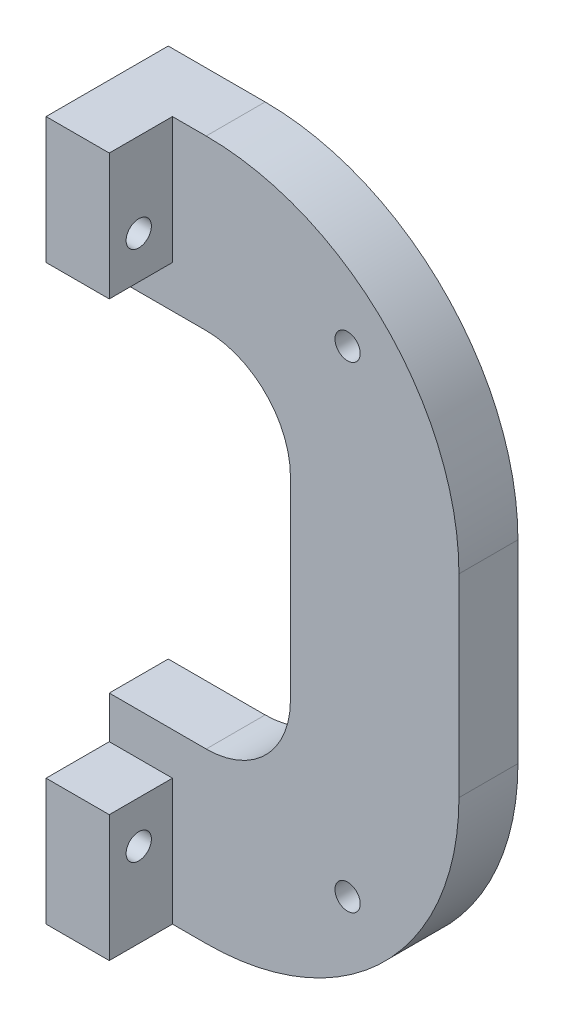
ISO-10303-21;
HEADER;
FILE_DESCRIPTION(('STEP AP214'),'2;1');
FILE_NAME('part.step','',(''),(''),'','','');
FILE_SCHEMA(('AUTOMOTIVE_DESIGN { 1 0 10303 214 1 1 1 1 }'));
ENDSEC;
DATA;
#1=APPLICATION_CONTEXT('core data for automotive mechanical design processes');
#2=APPLICATION_PROTOCOL_DEFINITION('international standard','automotive_design',2000,#1);
#3=PRODUCT_CONTEXT('',#1,'mechanical');
#4=PRODUCT('Part','Part','',(#3));
#5=PRODUCT_RELATED_PRODUCT_CATEGORY('part','',(#4));
#6=PRODUCT_DEFINITION_FORMATION('','',#4);
#7=PRODUCT_DEFINITION_CONTEXT('part definition',#1,'design');
#8=PRODUCT_DEFINITION('design','',#6,#7);
#9=PRODUCT_DEFINITION_SHAPE('','',#8);
#10=(LENGTH_UNIT() NAMED_UNIT(*) SI_UNIT(.MILLI.,.METRE.));
#11=(NAMED_UNIT(*) PLANE_ANGLE_UNIT() SI_UNIT($,.RADIAN.));
#12=(NAMED_UNIT(*) SI_UNIT($,.STERADIAN.) SOLID_ANGLE_UNIT());
#13=UNCERTAINTY_MEASURE_WITH_UNIT(LENGTH_MEASURE(1.E-05),#10,'distance_accuracy_value','');
#14=(GEOMETRIC_REPRESENTATION_CONTEXT(3) GLOBAL_UNCERTAINTY_ASSIGNED_CONTEXT((#13)) GLOBAL_UNIT_ASSIGNED_CONTEXT((#10,
#11,#12)) REPRESENTATION_CONTEXT('',''));
#15=CARTESIAN_POINT('',(0.,0.,0.));
#16=DIRECTION('',(0.,0.,1.));
#17=DIRECTION('',(1.,0.,0.));
#18=AXIS2_PLACEMENT_3D('',#15,#16,#17);
#19=CARTESIAN_POINT('',(0.,0.,7.));
#20=DIRECTION('',(0.,0.,1.));
#21=DIRECTION('',(1.,0.,0.));
#22=AXIS2_PLACEMENT_3D('',#19,#20,#21);
#23=PLANE('',#22);
#24=CARTESIAN_POINT('',(28.2842712474618,28.284271247462,7.));
#25=DIRECTION('',(0.,0.,1.));
#26=DIRECTION('',(1.,0.,0.));
#27=AXIS2_PLACEMENT_3D('',#24,#25,#26);
#28=CIRCLE('',#27,1.5);
#29=CARTESIAN_POINT('',(29.7842712474618,28.284271247462,7.));
#30=VERTEX_POINT('',#29);
#31=EDGE_CURVE('E199',#30,#30,#28,.T.);
#32=ORIENTED_EDGE('',*,*,#31,.F.);
#33=EDGE_LOOP('',(#32));
#34=FACE_BOUND('',#33,.T.);
#35=CARTESIAN_POINT('',(28.2842712474618,-28.284271247462,7.));
#36=DIRECTION('',(0.,0.,1.));
#37=DIRECTION('',(1.,0.,0.));
#38=AXIS2_PLACEMENT_3D('',#35,#36,#37);
#39=CIRCLE('',#38,1.5);
#40=CARTESIAN_POINT('',(29.7842712474618,-28.284271247462,7.));
#41=VERTEX_POINT('',#40);
#42=EDGE_CURVE('E187',#41,#41,#39,.T.);
#43=ORIENTED_EDGE('',*,*,#42,.F.);
#44=EDGE_LOOP('',(#43));
#45=FACE_BOUND('',#44,.T.);
#46=DIRECTION('',(1.,0.,0.));
#47=VECTOR('',#46,1.);
#48=CARTESIAN_POINT('',(0.,-21.5,7.));
#49=LINE('',#48,#47);
#50=CARTESIAN_POINT('',(0.,-21.5,7.));
#51=VERTEX_POINT('',#50);
#52=CARTESIAN_POINT('',(11.4999999999999,-21.5,7.));
#53=VERTEX_POINT('',#52);
#54=EDGE_CURVE('E262',#51,#53,#49,.T.);
#55=ORIENTED_EDGE('',*,*,#54,.F.);
#56=DIRECTION('',(0.,1.,0.));
#57=VECTOR('',#56,1.);
#58=CARTESIAN_POINT('',(0.,-26.5,7.));
#59=LINE('',#58,#57);
#60=CARTESIAN_POINT('',(0.,-26.5,7.));
#61=VERTEX_POINT('',#60);
#62=EDGE_CURVE('E190',#61,#51,#59,.T.);
#63=ORIENTED_EDGE('',*,*,#62,.F.);
#64=DIRECTION('',(1.,0.,0.));
#65=VECTOR('',#64,1.);
#66=CARTESIAN_POINT('',(0.,-26.5,7.));
#67=LINE('',#66,#65);
#68=CARTESIAN_POINT('',(7.50000000000001,-26.5,7.));
#69=VERTEX_POINT('',#68);
#70=EDGE_CURVE('E184',#61,#69,#67,.T.);
#71=ORIENTED_EDGE('',*,*,#70,.T.);
#72=DIRECTION('',(0.,1.,0.));
#73=VECTOR('',#72,1.);
#74=CARTESIAN_POINT('',(7.5,-41.5,7.));
#75=LINE('',#74,#73);
#76=CARTESIAN_POINT('',(7.5,-41.5,7.));
#77=VERTEX_POINT('',#76);
#78=EDGE_CURVE('E208',#77,#69,#75,.T.);
#79=ORIENTED_EDGE('',*,*,#78,.F.);
#80=DIRECTION('',(1.,0.,0.));
#81=VECTOR('',#80,1.);
#82=CARTESIAN_POINT('',(0.,-41.5,7.));
#83=LINE('',#82,#81);
#84=CARTESIAN_POINT('',(11.4999999999999,-41.5,7.));
#85=VERTEX_POINT('',#84);
#86=EDGE_CURVE('E264',#77,#85,#83,.T.);
#87=ORIENTED_EDGE('',*,*,#86,.T.);
#88=CARTESIAN_POINT('',(11.5,-11.5,7.));
#89=DIRECTION('',(0.,0.,1.));
#90=DIRECTION('',(1.,0.,0.));
#91=AXIS2_PLACEMENT_3D('',#88,#89,#90);
#92=CIRCLE('',#91,30.);
#93=CARTESIAN_POINT('',(41.5,-11.4999999999998,7.));
#94=VERTEX_POINT('',#93);
#95=EDGE_CURVE('E266',#85,#94,#92,.T.);
#96=ORIENTED_EDGE('',*,*,#95,.T.);
#97=DIRECTION('',(0.,1.,0.));
#98=VECTOR('',#97,1.);
#99=CARTESIAN_POINT('',(41.5,0.,7.));
#100=LINE('',#99,#98);
#101=CARTESIAN_POINT('',(41.5,11.4999999999999,7.));
#102=VERTEX_POINT('',#101);
#103=EDGE_CURVE('E243',#94,#102,#100,.T.);
#104=ORIENTED_EDGE('',*,*,#103,.T.);
#105=CARTESIAN_POINT('',(11.5,11.5,7.));
#106=DIRECTION('',(0.,0.,1.));
#107=DIRECTION('',(1.,0.,0.));
#108=AXIS2_PLACEMENT_3D('',#105,#106,#107);
#109=CIRCLE('',#108,30.);
#110=CARTESIAN_POINT('',(11.5,41.5,7.));
#111=VERTEX_POINT('',#110);
#112=EDGE_CURVE('E246',#102,#111,#109,.T.);
#113=ORIENTED_EDGE('',*,*,#112,.T.);
#114=DIRECTION('',(-1.,0.,0.));
#115=VECTOR('',#114,1.);
#116=CARTESIAN_POINT('',(0.,41.5,7.));
#117=LINE('',#116,#115);
#118=CARTESIAN_POINT('',(7.5,41.5,7.));
#119=VERTEX_POINT('',#118);
#120=EDGE_CURVE('E249',#111,#119,#117,.T.);
#121=ORIENTED_EDGE('',*,*,#120,.T.);
#122=DIRECTION('',(0.,1.,0.));
#123=VECTOR('',#122,1.);
#124=CARTESIAN_POINT('',(7.5,41.5,7.));
#125=LINE('',#124,#123);
#126=CARTESIAN_POINT('',(7.5,26.5,7.));
#127=VERTEX_POINT('',#126);
#128=EDGE_CURVE('E169',#127,#119,#125,.T.);
#129=ORIENTED_EDGE('',*,*,#128,.F.);
#130=DIRECTION('',(1.,0.,0.));
#131=VECTOR('',#130,1.);
#132=CARTESIAN_POINT('',(0.,26.5,7.));
#133=LINE('',#132,#131);
#134=CARTESIAN_POINT('',(0.,26.5,7.));
#135=VERTEX_POINT('',#134);
#136=EDGE_CURVE('E162',#135,#127,#133,.T.);
#137=ORIENTED_EDGE('',*,*,#136,.F.);
#138=DIRECTION('',(0.,1.,0.));
#139=VECTOR('',#138,1.);
#140=CARTESIAN_POINT('',(0.,26.5,7.));
#141=LINE('',#140,#139);
#142=CARTESIAN_POINT('',(0.,21.5,7.));
#143=VERTEX_POINT('',#142);
#144=EDGE_CURVE('E166',#143,#135,#141,.T.);
#145=ORIENTED_EDGE('',*,*,#144,.F.);
#146=DIRECTION('',(-1.,0.,0.));
#147=VECTOR('',#146,1.);
#148=CARTESIAN_POINT('',(0.,21.5,7.));
#149=LINE('',#148,#147);
#150=CARTESIAN_POINT('',(11.4999999999999,21.5,7.));
#151=VERTEX_POINT('',#150);
#152=EDGE_CURVE('E251',#151,#143,#149,.T.);
#153=ORIENTED_EDGE('',*,*,#152,.F.);
#154=CARTESIAN_POINT('',(11.5,11.5,7.));
#155=DIRECTION('',(0.,0.,1.));
#156=DIRECTION('',(1.,0.,0.));
#157=AXIS2_PLACEMENT_3D('',#154,#155,#156);
#158=CIRCLE('',#157,10.);
#159=CARTESIAN_POINT('',(21.5,11.4999999999999,7.));
#160=VERTEX_POINT('',#159);
#161=EDGE_CURVE('E253',#160,#151,#158,.T.);
#162=ORIENTED_EDGE('',*,*,#161,.F.);
#163=DIRECTION('',(0.,1.,0.));
#164=VECTOR('',#163,1.);
#165=CARTESIAN_POINT('',(21.5,0.,7.));
#166=LINE('',#165,#164);
#167=CARTESIAN_POINT('',(21.5,-11.4999999999999,7.));
#168=VERTEX_POINT('',#167);
#169=EDGE_CURVE('E256',#168,#160,#166,.T.);
#170=ORIENTED_EDGE('',*,*,#169,.F.);
#171=CARTESIAN_POINT('',(11.5,-11.5,7.));
#172=DIRECTION('',(0.,0.,1.));
#173=DIRECTION('',(1.,0.,0.));
#174=AXIS2_PLACEMENT_3D('',#171,#172,#173);
#175=CIRCLE('',#174,10.);
#176=EDGE_CURVE('E259',#53,#168,#175,.T.);
#177=ORIENTED_EDGE('',*,*,#176,.F.);
#178=EDGE_LOOP('',(#55,#63,#71,#79,#87,#96,#104,#113,#121,#129,#137,#145,#153,#162,#170,#177));
#179=FACE_BOUND('',#178,.T.);
#180=ADVANCED_FACE('F35',(#34,#45,#179),#23,.T.);
#181=CARTESIAN_POINT('',(41.5,0.,7.));
#182=DIRECTION('',(-1.,0.,0.));
#183=DIRECTION('',(0.,-1.,0.));
#184=AXIS2_PLACEMENT_3D('',#181,#182,#183);
#185=PLANE('',#184);
#186=DIRECTION('',(0.,1.,0.));
#187=VECTOR('',#186,1.);
#188=CARTESIAN_POINT('',(41.5,0.,0.));
#189=LINE('',#188,#187);
#190=CARTESIAN_POINT('',(41.5,-11.4999999999998,0.));
#191=VERTEX_POINT('',#190);
#192=CARTESIAN_POINT('',(41.5,11.4999999999999,0.));
#193=VERTEX_POINT('',#192);
#194=EDGE_CURVE('E242',#191,#193,#189,.T.);
#195=ORIENTED_EDGE('',*,*,#194,.T.);
#196=DIRECTION('',(0.,0.,-1.));
#197=VECTOR('',#196,1.);
#198=CARTESIAN_POINT('',(41.5,11.4999999999999,7.));
#199=LINE('',#198,#197);
#200=EDGE_CURVE('E11',#102,#193,#199,.T.);
#201=ORIENTED_EDGE('',*,*,#200,.F.);
#202=ORIENTED_EDGE('',*,*,#103,.F.);
#203=DIRECTION('',(0.,0.,-1.));
#204=VECTOR('',#203,1.);
#205=CARTESIAN_POINT('',(41.5,-11.4999999999998,7.));
#206=LINE('',#205,#204);
#207=EDGE_CURVE('E268',#94,#191,#206,.T.);
#208=ORIENTED_EDGE('',*,*,#207,.T.);
#209=EDGE_LOOP('',(#195,#201,#202,#208));
#210=FACE_BOUND('',#209,.T.);
#211=ADVANCED_FACE('F37',(#210),#185,.F.);
#212=CARTESIAN_POINT('',(11.5,11.5,7.));
#213=DIRECTION('',(0.,0.,-1.));
#214=DIRECTION('',(-1.,0.,0.));
#215=AXIS2_PLACEMENT_3D('',#212,#213,#214);
#216=CYLINDRICAL_SURFACE('',#215,30.);
#217=CARTESIAN_POINT('',(11.5,11.5,0.));
#218=DIRECTION('',(0.,0.,1.));
#219=DIRECTION('',(1.,0.,0.));
#220=AXIS2_PLACEMENT_3D('',#217,#218,#219);
#221=CIRCLE('',#220,30.);
#222=CARTESIAN_POINT('',(11.5,41.5,0.));
#223=VERTEX_POINT('',#222);
#224=EDGE_CURVE('E271',#193,#223,#221,.T.);
#225=ORIENTED_EDGE('',*,*,#224,.T.);
#226=DIRECTION('',(0.,0.,-1.));
#227=VECTOR('',#226,1.);
#228=CARTESIAN_POINT('',(11.5,41.5,7.));
#229=LINE('',#228,#227);
#230=EDGE_CURVE('E44',#111,#223,#229,.T.);
#231=ORIENTED_EDGE('',*,*,#230,.F.);
#232=ORIENTED_EDGE('',*,*,#112,.F.);
#233=ORIENTED_EDGE('',*,*,#200,.T.);
#234=EDGE_LOOP('',(#225,#231,#232,#233));
#235=FACE_BOUND('',#234,.T.);
#236=ADVANCED_FACE('F349',(#235),#216,.T.);
#237=CARTESIAN_POINT('',(0.,41.5,7.));
#238=DIRECTION('',(0.,-1.,0.));
#239=DIRECTION('',(0.,0.,-1.));
#240=AXIS2_PLACEMENT_3D('',#237,#238,#239);
#241=PLANE('',#240);
#242=DIRECTION('',(-1.,0.,0.));
#243=VECTOR('',#242,1.);
#244=CARTESIAN_POINT('',(0.,41.5,0.));
#245=LINE('',#244,#243);
#246=CARTESIAN_POINT('',(0.,41.5,0.));
#247=VERTEX_POINT('',#246);
#248=EDGE_CURVE('E273',#223,#247,#245,.T.);
#249=ORIENTED_EDGE('',*,*,#248,.T.);
#250=DIRECTION('',(0.,0.,-1.));
#251=VECTOR('',#250,1.);
#252=CARTESIAN_POINT('',(0.,41.5,7.));
#253=LINE('',#252,#251);
#254=CARTESIAN_POINT('',(0.,41.5,14.5));
#255=VERTEX_POINT('',#254);
#256=EDGE_CURVE('E318',#255,#247,#253,.T.);
#257=ORIENTED_EDGE('',*,*,#256,.F.);
#258=DIRECTION('',(-1.,0.,0.));
#259=VECTOR('',#258,1.);
#260=CARTESIAN_POINT('',(0.,41.5,14.5));
#261=LINE('',#260,#259);
#262=CARTESIAN_POINT('',(7.5,41.5,14.5));
#263=VERTEX_POINT('',#262);
#264=EDGE_CURVE('E233',#263,#255,#261,.T.);
#265=ORIENTED_EDGE('',*,*,#264,.F.);
#266=DIRECTION('',(0.,0.,-1.));
#267=VECTOR('',#266,1.);
#268=CARTESIAN_POINT('',(7.5,41.5,14.5));
#269=LINE('',#268,#267);
#270=EDGE_CURVE('E238',#263,#119,#269,.T.);
#271=ORIENTED_EDGE('',*,*,#270,.T.);
#272=ORIENTED_EDGE('',*,*,#120,.F.);
#273=ORIENTED_EDGE('',*,*,#230,.T.);
#274=EDGE_LOOP('',(#249,#257,#265,#271,#272,#273));
#275=FACE_BOUND('',#274,.T.);
#276=ADVANCED_FACE('F393',(#275),#241,.F.);
#277=CARTESIAN_POINT('',(0.,0.,7.));
#278=DIRECTION('',(-1.,0.,0.));
#279=DIRECTION('',(0.,0.,1.));
#280=AXIS2_PLACEMENT_3D('',#277,#278,#279);
#281=PLANE('',#280);
#282=ORIENTED_EDGE('',*,*,#144,.T.);
#283=DIRECTION('',(0.,0.,1.));
#284=VECTOR('',#283,1.);
#285=CARTESIAN_POINT('',(0.,26.5,14.5));
#286=LINE('',#285,#284);
#287=CARTESIAN_POINT('',(0.,26.5,14.5));
#288=VERTEX_POINT('',#287);
#289=EDGE_CURVE('E171',#135,#288,#286,.T.);
#290=ORIENTED_EDGE('',*,*,#289,.T.);
#291=DIRECTION('',(0.,-1.,0.));
#292=VECTOR('',#291,1.);
#293=CARTESIAN_POINT('',(0.,21.5,14.5));
#294=LINE('',#293,#292);
#295=EDGE_CURVE('E236',#255,#288,#294,.T.);
#296=ORIENTED_EDGE('',*,*,#295,.F.);
#297=ORIENTED_EDGE('',*,*,#256,.T.);
#298=DIRECTION('',(0.,1.,0.));
#299=VECTOR('',#298,1.);
#300=CARTESIAN_POINT('',(0.,0.,0.));
#301=LINE('',#300,#299);
#302=CARTESIAN_POINT('',(0.,21.5,0.));
#303=VERTEX_POINT('',#302);
#304=EDGE_CURVE('E276',#303,#247,#301,.T.);
#305=ORIENTED_EDGE('',*,*,#304,.F.);
#306=DIRECTION('',(0.,0.,-1.));
#307=VECTOR('',#306,1.);
#308=CARTESIAN_POINT('',(0.,21.5,7.));
#309=LINE('',#308,#307);
#310=EDGE_CURVE('E182',#143,#303,#309,.T.);
#311=ORIENTED_EDGE('',*,*,#310,.F.);
#312=EDGE_LOOP('',(#282,#290,#296,#297,#305,#311));
#313=FACE_BOUND('',#312,.T.);
#314=CARTESIAN_POINT('',(0.,31.5,11.));
#315=DIRECTION('',(1.,0.,0.));
#316=DIRECTION('',(0.,1.,0.));
#317=AXIS2_PLACEMENT_3D('',#314,#315,#316);
#318=CIRCLE('',#317,1.5);
#319=CARTESIAN_POINT('',(0.,33.,11.));
#320=VERTEX_POINT('',#319);
#321=EDGE_CURVE('E205',#320,#320,#318,.T.);
#322=ORIENTED_EDGE('',*,*,#321,.T.);
#323=EDGE_LOOP('',(#322));
#324=FACE_BOUND('',#323,.T.);
#325=ADVANCED_FACE('F179',(#313,#324),#281,.T.);
#326=CARTESIAN_POINT('',(0.,21.5,7.));
#327=DIRECTION('',(0.,-1.,0.));
#328=DIRECTION('',(0.,0.,-1.));
#329=AXIS2_PLACEMENT_3D('',#326,#327,#328);
#330=PLANE('',#329);
#331=ORIENTED_EDGE('',*,*,#152,.T.);
#332=ORIENTED_EDGE('',*,*,#310,.T.);
#333=DIRECTION('',(-1.,0.,0.));
#334=VECTOR('',#333,1.);
#335=CARTESIAN_POINT('',(0.,21.5,0.));
#336=LINE('',#335,#334);
#337=CARTESIAN_POINT('',(11.4999999999999,21.5,0.));
#338=VERTEX_POINT('',#337);
#339=EDGE_CURVE('E279',#338,#303,#336,.T.);
#340=ORIENTED_EDGE('',*,*,#339,.F.);
#341=DIRECTION('',(0.,0.,-1.));
#342=VECTOR('',#341,1.);
#343=CARTESIAN_POINT('',(11.4999999999999,21.5,7.));
#344=LINE('',#343,#342);
#345=EDGE_CURVE('E315',#151,#338,#344,.T.);
#346=ORIENTED_EDGE('',*,*,#345,.F.);
#347=EDGE_LOOP('',(#331,#332,#340,#346));
#348=FACE_BOUND('',#347,.T.);
#349=ADVANCED_FACE('F386',(#348),#330,.T.);
#350=CARTESIAN_POINT('',(11.5,11.5,7.));
#351=DIRECTION('',(0.,0.,-1.));
#352=DIRECTION('',(-1.,0.,0.));
#353=AXIS2_PLACEMENT_3D('',#350,#351,#352);
#354=CYLINDRICAL_SURFACE('',#353,10.);
#355=CARTESIAN_POINT('',(11.5,11.5,0.));
#356=DIRECTION('',(0.,0.,1.));
#357=DIRECTION('',(1.,0.,0.));
#358=AXIS2_PLACEMENT_3D('',#355,#356,#357);
#359=CIRCLE('',#358,10.);
#360=CARTESIAN_POINT('',(21.5,11.4999999999999,0.));
#361=VERTEX_POINT('',#360);
#362=EDGE_CURVE('E282',#361,#338,#359,.T.);
#363=ORIENTED_EDGE('',*,*,#362,.F.);
#364=DIRECTION('',(0.,0.,-1.));
#365=VECTOR('',#364,1.);
#366=CARTESIAN_POINT('',(21.5,11.4999999999999,7.));
#367=LINE('',#366,#365);
#368=EDGE_CURVE('E313',#160,#361,#367,.T.);
#369=ORIENTED_EDGE('',*,*,#368,.F.);
#370=ORIENTED_EDGE('',*,*,#161,.T.);
#371=ORIENTED_EDGE('',*,*,#345,.T.);
#372=EDGE_LOOP('',(#363,#369,#370,#371));
#373=FACE_BOUND('',#372,.T.);
#374=ADVANCED_FACE('F382',(#373),#354,.F.);
#375=CARTESIAN_POINT('',(21.5,0.,7.));
#376=DIRECTION('',(-1.,0.,0.));
#377=DIRECTION('',(0.,0.,1.));
#378=AXIS2_PLACEMENT_3D('',#375,#376,#377);
#379=PLANE('',#378);
#380=DIRECTION('',(0.,1.,0.));
#381=VECTOR('',#380,1.);
#382=CARTESIAN_POINT('',(21.5,0.,0.));
#383=LINE('',#382,#381);
#384=CARTESIAN_POINT('',(21.5,-11.4999999999999,0.));
#385=VERTEX_POINT('',#384);
#386=EDGE_CURVE('E285',#385,#361,#383,.T.);
#387=ORIENTED_EDGE('',*,*,#386,.F.);
#388=DIRECTION('',(0.,0.,-1.));
#389=VECTOR('',#388,1.);
#390=CARTESIAN_POINT('',(21.5,-11.4999999999999,7.));
#391=LINE('',#390,#389);
#392=EDGE_CURVE('E311',#168,#385,#391,.T.);
#393=ORIENTED_EDGE('',*,*,#392,.F.);
#394=ORIENTED_EDGE('',*,*,#169,.T.);
#395=ORIENTED_EDGE('',*,*,#368,.T.);
#396=EDGE_LOOP('',(#387,#393,#394,#395));
#397=FACE_BOUND('',#396,.T.);
#398=ADVANCED_FACE('F378',(#397),#379,.T.);
#399=CARTESIAN_POINT('',(11.5,-11.5,7.));
#400=DIRECTION('',(0.,0.,-1.));
#401=DIRECTION('',(-1.,0.,0.));
#402=AXIS2_PLACEMENT_3D('',#399,#400,#401);
#403=CYLINDRICAL_SURFACE('',#402,10.);
#404=CARTESIAN_POINT('',(11.5,-11.5,0.));
#405=DIRECTION('',(0.,0.,1.));
#406=DIRECTION('',(1.,0.,0.));
#407=AXIS2_PLACEMENT_3D('',#404,#405,#406);
#408=CIRCLE('',#407,10.);
#409=CARTESIAN_POINT('',(11.4999999999999,-21.5,0.));
#410=VERTEX_POINT('',#409);
#411=EDGE_CURVE('E288',#410,#385,#408,.T.);
#412=ORIENTED_EDGE('',*,*,#411,.F.);
#413=DIRECTION('',(0.,0.,-1.));
#414=VECTOR('',#413,1.);
#415=CARTESIAN_POINT('',(11.4999999999999,-21.5,7.));
#416=LINE('',#415,#414);
#417=EDGE_CURVE('E309',#53,#410,#416,.T.);
#418=ORIENTED_EDGE('',*,*,#417,.F.);
#419=ORIENTED_EDGE('',*,*,#176,.T.);
#420=ORIENTED_EDGE('',*,*,#392,.T.);
#421=EDGE_LOOP('',(#412,#418,#419,#420));
#422=FACE_BOUND('',#421,.T.);
#423=ADVANCED_FACE('F374',(#422),#403,.F.);
#424=CARTESIAN_POINT('',(0.,-21.5,7.));
#425=DIRECTION('',(0.,1.,0.));
#426=DIRECTION('',(0.,0.,1.));
#427=AXIS2_PLACEMENT_3D('',#424,#425,#426);
#428=PLANE('',#427);
#429=DIRECTION('',(0.,0.,-1.));
#430=VECTOR('',#429,1.);
#431=CARTESIAN_POINT('',(0.,-21.5,7.));
#432=LINE('',#431,#430);
#433=CARTESIAN_POINT('',(0.,-21.5,0.));
#434=VERTEX_POINT('',#433);
#435=EDGE_CURVE('E307',#51,#434,#432,.T.);
#436=ORIENTED_EDGE('',*,*,#435,.F.);
#437=ORIENTED_EDGE('',*,*,#54,.T.);
#438=ORIENTED_EDGE('',*,*,#417,.T.);
#439=DIRECTION('',(1.,0.,0.));
#440=VECTOR('',#439,1.);
#441=CARTESIAN_POINT('',(0.,-21.5,0.));
#442=LINE('',#441,#440);
#443=EDGE_CURVE('E291',#434,#410,#442,.T.);
#444=ORIENTED_EDGE('',*,*,#443,.F.);
#445=EDGE_LOOP('',(#436,#437,#438,#444));
#446=FACE_BOUND('',#445,.T.);
#447=ADVANCED_FACE('F370',(#446),#428,.T.);
#448=CARTESIAN_POINT('',(0.,0.,7.));
#449=DIRECTION('',(1.,0.,0.));
#450=DIRECTION('',(0.,1.,0.));
#451=AXIS2_PLACEMENT_3D('',#448,#449,#450);
#452=PLANE('',#451);
#453=CARTESIAN_POINT('',(0.,-31.5,11.));
#454=DIRECTION('',(1.,0.,0.));
#455=DIRECTION('',(0.,-1.,0.));
#456=AXIS2_PLACEMENT_3D('',#453,#454,#455);
#457=CIRCLE('',#456,1.5);
#458=CARTESIAN_POINT('',(0.,-33.,11.));
#459=VERTEX_POINT('',#458);
#460=EDGE_CURVE('E212',#459,#459,#457,.T.);
#461=ORIENTED_EDGE('',*,*,#460,.T.);
#462=EDGE_LOOP('',(#461));
#463=FACE_BOUND('',#462,.T.);
#464=DIRECTION('',(0.,0.,-1.));
#465=VECTOR('',#464,1.);
#466=CARTESIAN_POINT('',(0.,-26.5,14.5));
#467=LINE('',#466,#465);
#468=CARTESIAN_POINT('',(0.,-26.5,14.5));
#469=VERTEX_POINT('',#468);
#470=EDGE_CURVE('E60',#469,#61,#467,.T.);
#471=ORIENTED_EDGE('',*,*,#470,.T.);
#472=ORIENTED_EDGE('',*,*,#62,.T.);
#473=ORIENTED_EDGE('',*,*,#435,.T.);
#474=DIRECTION('',(0.,-1.,0.));
#475=VECTOR('',#474,1.);
#476=CARTESIAN_POINT('',(0.,0.,0.));
#477=LINE('',#476,#475);
#478=CARTESIAN_POINT('',(0.,-41.5,0.));
#479=VERTEX_POINT('',#478);
#480=EDGE_CURVE('E294',#434,#479,#477,.T.);
#481=ORIENTED_EDGE('',*,*,#480,.T.);
#482=DIRECTION('',(0.,0.,-1.));
#483=VECTOR('',#482,1.);
#484=CARTESIAN_POINT('',(0.,-41.5,7.));
#485=LINE('',#484,#483);
#486=CARTESIAN_POINT('',(0.,-41.5,14.5));
#487=VERTEX_POINT('',#486);
#488=EDGE_CURVE('E304',#487,#479,#485,.T.);
#489=ORIENTED_EDGE('',*,*,#488,.F.);
#490=DIRECTION('',(0.,-1.,0.));
#491=VECTOR('',#490,1.);
#492=CARTESIAN_POINT('',(0.,-21.5,14.5));
#493=LINE('',#492,#491);
#494=EDGE_CURVE('E224',#469,#487,#493,.T.);
#495=ORIENTED_EDGE('',*,*,#494,.F.);
#496=EDGE_LOOP('',(#471,#472,#473,#481,#489,#495));
#497=FACE_BOUND('',#496,.T.);
#498=ADVANCED_FACE('F366',(#463,#497),#452,.F.);
#499=CARTESIAN_POINT('',(0.,-41.5,7.));
#500=DIRECTION('',(0.,1.,0.));
#501=DIRECTION('',(0.,0.,1.));
#502=AXIS2_PLACEMENT_3D('',#499,#500,#501);
#503=PLANE('',#502);
#504=DIRECTION('',(1.,0.,0.));
#505=VECTOR('',#504,1.);
#506=CARTESIAN_POINT('',(0.,-41.5,0.));
#507=LINE('',#506,#505);
#508=CARTESIAN_POINT('',(11.4999999999999,-41.5,0.));
#509=VERTEX_POINT('',#508);
#510=EDGE_CURVE('E296',#479,#509,#507,.T.);
#511=ORIENTED_EDGE('',*,*,#510,.T.);
#512=DIRECTION('',(0.,0.,-1.));
#513=VECTOR('',#512,1.);
#514=CARTESIAN_POINT('',(11.4999999999999,-41.5,7.));
#515=LINE('',#514,#513);
#516=EDGE_CURVE('E301',#85,#509,#515,.T.);
#517=ORIENTED_EDGE('',*,*,#516,.F.);
#518=ORIENTED_EDGE('',*,*,#86,.F.);
#519=DIRECTION('',(0.,0.,-1.));
#520=VECTOR('',#519,1.);
#521=CARTESIAN_POINT('',(7.5,-41.5,14.5));
#522=LINE('',#521,#520);
#523=CARTESIAN_POINT('',(7.5,-41.5,14.5));
#524=VERTEX_POINT('',#523);
#525=EDGE_CURVE('E226',#524,#77,#522,.T.);
#526=ORIENTED_EDGE('',*,*,#525,.F.);
#527=DIRECTION('',(1.,0.,0.));
#528=VECTOR('',#527,1.);
#529=CARTESIAN_POINT('',(0.,-41.5,14.5));
#530=LINE('',#529,#528);
#531=EDGE_CURVE('E218',#487,#524,#530,.T.);
#532=ORIENTED_EDGE('',*,*,#531,.F.);
#533=ORIENTED_EDGE('',*,*,#488,.T.);
#534=EDGE_LOOP('',(#511,#517,#518,#526,#532,#533));
#535=FACE_BOUND('',#534,.T.);
#536=ADVANCED_FACE('F362',(#535),#503,.F.);
#537=CARTESIAN_POINT('',(11.5,-11.5,7.));
#538=DIRECTION('',(0.,0.,-1.));
#539=DIRECTION('',(-1.,0.,0.));
#540=AXIS2_PLACEMENT_3D('',#537,#538,#539);
#541=CYLINDRICAL_SURFACE('',#540,30.);
#542=CARTESIAN_POINT('',(11.5,-11.5,0.));
#543=DIRECTION('',(0.,0.,1.));
#544=DIRECTION('',(1.,0.,0.));
#545=AXIS2_PLACEMENT_3D('',#542,#543,#544);
#546=CIRCLE('',#545,30.);
#547=EDGE_CURVE('E247',#509,#191,#546,.T.);
#548=ORIENTED_EDGE('',*,*,#547,.T.);
#549=ORIENTED_EDGE('',*,*,#207,.F.);
#550=ORIENTED_EDGE('',*,*,#95,.F.);
#551=ORIENTED_EDGE('',*,*,#516,.T.);
#552=EDGE_LOOP('',(#548,#549,#550,#551));
#553=FACE_BOUND('',#552,.T.);
#554=ADVANCED_FACE('F359',(#553),#541,.T.);
#555=CARTESIAN_POINT('',(0.,0.,0.));
#556=DIRECTION('',(0.,0.,1.));
#557=DIRECTION('',(1.,0.,0.));
#558=AXIS2_PLACEMENT_3D('',#555,#556,#557);
#559=PLANE('',#558);
#560=CARTESIAN_POINT('',(28.2842712474618,28.284271247462,0.));
#561=DIRECTION('',(0.,0.,1.));
#562=DIRECTION('',(1.,0.,0.));
#563=AXIS2_PLACEMENT_3D('',#560,#561,#562);
#564=CIRCLE('',#563,1.5);
#565=CARTESIAN_POINT('',(29.7842712474618,28.284271247462,0.));
#566=VERTEX_POINT('',#565);
#567=EDGE_CURVE('E39',#566,#566,#564,.T.);
#568=ORIENTED_EDGE('',*,*,#567,.T.);
#569=EDGE_LOOP('',(#568));
#570=FACE_BOUND('',#569,.T.);
#571=CARTESIAN_POINT('',(28.2842712474618,-28.284271247462,0.));
#572=DIRECTION('',(0.,0.,1.));
#573=DIRECTION('',(1.,0.,0.));
#574=AXIS2_PLACEMENT_3D('',#571,#572,#573);
#575=CIRCLE('',#574,1.5);
#576=CARTESIAN_POINT('',(29.7842712474618,-28.284271247462,0.));
#577=VERTEX_POINT('',#576);
#578=EDGE_CURVE('E202',#577,#577,#575,.T.);
#579=ORIENTED_EDGE('',*,*,#578,.T.);
#580=EDGE_LOOP('',(#579));
#581=FACE_BOUND('',#580,.T.);
#582=ORIENTED_EDGE('',*,*,#194,.F.);
#583=ORIENTED_EDGE('',*,*,#547,.F.);
#584=ORIENTED_EDGE('',*,*,#510,.F.);
#585=ORIENTED_EDGE('',*,*,#480,.F.);
#586=ORIENTED_EDGE('',*,*,#443,.T.);
#587=ORIENTED_EDGE('',*,*,#411,.T.);
#588=ORIENTED_EDGE('',*,*,#386,.T.);
#589=ORIENTED_EDGE('',*,*,#362,.T.);
#590=ORIENTED_EDGE('',*,*,#339,.T.);
#591=ORIENTED_EDGE('',*,*,#304,.T.);
#592=ORIENTED_EDGE('',*,*,#248,.F.);
#593=ORIENTED_EDGE('',*,*,#224,.F.);
#594=EDGE_LOOP('',(#582,#583,#584,#585,#586,#587,#588,#589,#590,#591,#592,#593));
#595=FACE_BOUND('',#594,.T.);
#596=ADVANCED_FACE('F327',(#570,#581,#595),#559,.F.);
#597=CARTESIAN_POINT('',(7.5,41.5,14.5));
#598=DIRECTION('',(-1.,0.,0.));
#599=DIRECTION('',(0.,-1.,0.));
#600=AXIS2_PLACEMENT_3D('',#597,#598,#599);
#601=PLANE('',#600);
#602=CARTESIAN_POINT('',(7.5,31.5,11.));
#603=DIRECTION('',(1.,0.,0.));
#604=DIRECTION('',(0.,1.,0.));
#605=AXIS2_PLACEMENT_3D('',#602,#603,#604);
#606=CIRCLE('',#605,1.5);
#607=CARTESIAN_POINT('',(7.5,33.,11.));
#608=VERTEX_POINT('',#607);
#609=EDGE_CURVE('E209',#608,#608,#606,.T.);
#610=ORIENTED_EDGE('',*,*,#609,.F.);
#611=EDGE_LOOP('',(#610));
#612=FACE_BOUND('',#611,.T.);
#613=DIRECTION('',(0.,1.,0.));
#614=VECTOR('',#613,1.);
#615=CARTESIAN_POINT('',(7.5,41.5,14.5));
#616=LINE('',#615,#614);
#617=CARTESIAN_POINT('',(7.5,26.5,14.5));
#618=VERTEX_POINT('',#617);
#619=EDGE_CURVE('E231',#618,#263,#616,.T.);
#620=ORIENTED_EDGE('',*,*,#619,.F.);
#621=DIRECTION('',(0.,0.,1.));
#622=VECTOR('',#621,1.);
#623=CARTESIAN_POINT('',(7.5,26.5,14.5));
#624=LINE('',#623,#622);
#625=EDGE_CURVE('E52',#127,#618,#624,.T.);
#626=ORIENTED_EDGE('',*,*,#625,.F.);
#627=ORIENTED_EDGE('',*,*,#128,.T.);
#628=ORIENTED_EDGE('',*,*,#270,.F.);
#629=EDGE_LOOP('',(#620,#626,#627,#628));
#630=FACE_BOUND('',#629,.T.);
#631=ADVANCED_FACE('F355',(#612,#630),#601,.F.);
#632=CARTESIAN_POINT('',(0.,0.,14.5));
#633=DIRECTION('',(0.,0.,-1.));
#634=DIRECTION('',(-1.,0.,0.));
#635=AXIS2_PLACEMENT_3D('',#632,#633,#634);
#636=PLANE('',#635);
#637=ORIENTED_EDGE('',*,*,#295,.T.);
#638=DIRECTION('',(1.,0.,0.));
#639=VECTOR('',#638,1.);
#640=CARTESIAN_POINT('',(0.,26.5,14.5));
#641=LINE('',#640,#639);
#642=EDGE_CURVE('E170',#288,#618,#641,.T.);
#643=ORIENTED_EDGE('',*,*,#642,.T.);
#644=ORIENTED_EDGE('',*,*,#619,.T.);
#645=ORIENTED_EDGE('',*,*,#264,.T.);
#646=EDGE_LOOP('',(#637,#643,#644,#645));
#647=FACE_BOUND('',#646,.T.);
#648=ADVANCED_FACE('F409',(#647),#636,.F.);
#649=CARTESIAN_POINT('',(7.5,-41.5,14.5));
#650=DIRECTION('',(-1.,0.,0.));
#651=DIRECTION('',(0.,-1.,0.));
#652=AXIS2_PLACEMENT_3D('',#649,#650,#651);
#653=PLANE('',#652);
#654=CARTESIAN_POINT('',(7.50000000000001,-31.5,11.));
#655=DIRECTION('',(1.,0.,0.));
#656=DIRECTION('',(0.,-1.,0.));
#657=AXIS2_PLACEMENT_3D('',#654,#655,#656);
#658=CIRCLE('',#657,1.5);
#659=CARTESIAN_POINT('',(7.50000000000001,-33.,11.));
#660=VERTEX_POINT('',#659);
#661=EDGE_CURVE('E215',#660,#660,#658,.T.);
#662=ORIENTED_EDGE('',*,*,#661,.F.);
#663=EDGE_LOOP('',(#662));
#664=FACE_BOUND('',#663,.T.);
#665=ORIENTED_EDGE('',*,*,#78,.T.);
#666=DIRECTION('',(0.,0.,-1.));
#667=VECTOR('',#666,1.);
#668=CARTESIAN_POINT('',(7.50000000000001,-26.5,14.5));
#669=LINE('',#668,#667);
#670=CARTESIAN_POINT('',(7.50000000000001,-26.5,14.5));
#671=VERTEX_POINT('',#670);
#672=EDGE_CURVE('E191',#671,#69,#669,.T.);
#673=ORIENTED_EDGE('',*,*,#672,.F.);
#674=DIRECTION('',(0.,1.,0.));
#675=VECTOR('',#674,1.);
#676=CARTESIAN_POINT('',(7.5,-41.5,14.5));
#677=LINE('',#676,#675);
#678=EDGE_CURVE('E221',#524,#671,#677,.T.);
#679=ORIENTED_EDGE('',*,*,#678,.F.);
#680=ORIENTED_EDGE('',*,*,#525,.T.);
#681=EDGE_LOOP('',(#665,#673,#679,#680));
#682=FACE_BOUND('',#681,.T.);
#683=ADVANCED_FACE('F438',(#664,#682),#653,.F.);
#684=CARTESIAN_POINT('',(0.,0.,14.5));
#685=DIRECTION('',(0.,0.,1.));
#686=DIRECTION('',(1.,0.,0.));
#687=AXIS2_PLACEMENT_3D('',#684,#685,#686);
#688=PLANE('',#687);
#689=DIRECTION('',(1.,0.,0.));
#690=VECTOR('',#689,1.);
#691=CARTESIAN_POINT('',(0.,-26.5,14.5));
#692=LINE('',#691,#690);
#693=EDGE_CURVE('E194',#469,#671,#692,.T.);
#694=ORIENTED_EDGE('',*,*,#693,.F.);
#695=ORIENTED_EDGE('',*,*,#494,.T.);
#696=ORIENTED_EDGE('',*,*,#531,.T.);
#697=ORIENTED_EDGE('',*,*,#678,.T.);
#698=EDGE_LOOP('',(#694,#695,#696,#697));
#699=FACE_BOUND('',#698,.T.);
#700=ADVANCED_FACE('F440',(#699),#688,.T.);
#701=CARTESIAN_POINT('',(0.,-31.5,11.));
#702=DIRECTION('',(1.,0.,0.));
#703=DIRECTION('',(0.,1.,0.));
#704=AXIS2_PLACEMENT_3D('',#701,#702,#703);
#705=CYLINDRICAL_SURFACE('',#704,1.5);
#706=ORIENTED_EDGE('',*,*,#460,.F.);
#707=EDGE_LOOP('',(#706));
#708=FACE_BOUND('',#707,.T.);
#709=ORIENTED_EDGE('',*,*,#661,.T.);
#710=EDGE_LOOP('',(#709));
#711=FACE_BOUND('',#710,.T.);
#712=ADVANCED_FACE('F442',(#708,#711),#705,.F.);
#713=CARTESIAN_POINT('',(0.,31.5,11.));
#714=DIRECTION('',(1.,0.,0.));
#715=DIRECTION('',(0.,1.,0.));
#716=AXIS2_PLACEMENT_3D('',#713,#714,#715);
#717=CYLINDRICAL_SURFACE('',#716,1.5);
#718=ORIENTED_EDGE('',*,*,#321,.F.);
#719=EDGE_LOOP('',(#718));
#720=FACE_BOUND('',#719,.T.);
#721=ORIENTED_EDGE('',*,*,#609,.T.);
#722=EDGE_LOOP('',(#721));
#723=FACE_BOUND('',#722,.T.);
#724=ADVANCED_FACE('F341',(#720,#723),#717,.F.);
#725=CARTESIAN_POINT('',(28.2842712474618,-28.284271247462,-0.5));
#726=DIRECTION('',(0.,0.,1.));
#727=DIRECTION('',(1.,0.,0.));
#728=AXIS2_PLACEMENT_3D('',#725,#726,#727);
#729=CYLINDRICAL_SURFACE('',#728,1.5);
#730=ORIENTED_EDGE('',*,*,#42,.T.);
#731=EDGE_LOOP('',(#730));
#732=FACE_BOUND('',#731,.T.);
#733=ORIENTED_EDGE('',*,*,#578,.F.);
#734=EDGE_LOOP('',(#733));
#735=FACE_BOUND('',#734,.T.);
#736=ADVANCED_FACE('F332',(#732,#735),#729,.F.);
#737=CARTESIAN_POINT('',(28.2842712474618,28.284271247462,-0.5));
#738=DIRECTION('',(0.,0.,1.));
#739=DIRECTION('',(1.,0.,0.));
#740=AXIS2_PLACEMENT_3D('',#737,#738,#739);
#741=CYLINDRICAL_SURFACE('',#740,1.5);
#742=ORIENTED_EDGE('',*,*,#31,.T.);
#743=EDGE_LOOP('',(#742));
#744=FACE_BOUND('',#743,.T.);
#745=ORIENTED_EDGE('',*,*,#567,.F.);
#746=EDGE_LOOP('',(#745));
#747=FACE_BOUND('',#746,.T.);
#748=ADVANCED_FACE('F329',(#744,#747),#741,.F.);
#749=CARTESIAN_POINT('',(0.,-26.5,14.5));
#750=DIRECTION('',(0.,-1.,0.));
#751=DIRECTION('',(1.,0.,0.));
#752=AXIS2_PLACEMENT_3D('',#749,#750,#751);
#753=PLANE('',#752);
#754=ORIENTED_EDGE('',*,*,#672,.T.);
#755=ORIENTED_EDGE('',*,*,#70,.F.);
#756=ORIENTED_EDGE('',*,*,#470,.F.);
#757=ORIENTED_EDGE('',*,*,#693,.T.);
#758=EDGE_LOOP('',(#754,#755,#756,#757));
#759=FACE_BOUND('',#758,.T.);
#760=ADVANCED_FACE('F331',(#759),#753,.F.);
#761=CARTESIAN_POINT('',(0.,26.5,14.5));
#762=DIRECTION('',(0.,1.,0.));
#763=DIRECTION('',(-1.,0.,0.));
#764=AXIS2_PLACEMENT_3D('',#761,#762,#763);
#765=PLANE('',#764);
#766=ORIENTED_EDGE('',*,*,#625,.T.);
#767=ORIENTED_EDGE('',*,*,#642,.F.);
#768=ORIENTED_EDGE('',*,*,#289,.F.);
#769=ORIENTED_EDGE('',*,*,#136,.T.);
#770=EDGE_LOOP('',(#766,#767,#768,#769));
#771=FACE_BOUND('',#770,.T.);
#772=ADVANCED_FACE('F174',(#771),#765,.F.);
#773=CLOSED_SHELL('',(#180,#211,#236,#276,#325,#349,#374,#398,#423,#447,#498,#536,#554,#596,
#631,#648,#683,#700,#712,#724,#736,#748,#760,#772));
#774=MANIFOLD_SOLID_BREP('B2',#773);
#775=ADVANCED_BREP_SHAPE_REPRESENTATION('',(#18,#774),#14);
#776=SHAPE_DEFINITION_REPRESENTATION(#9,#775);
ENDSEC;
END-ISO-10303-21;
